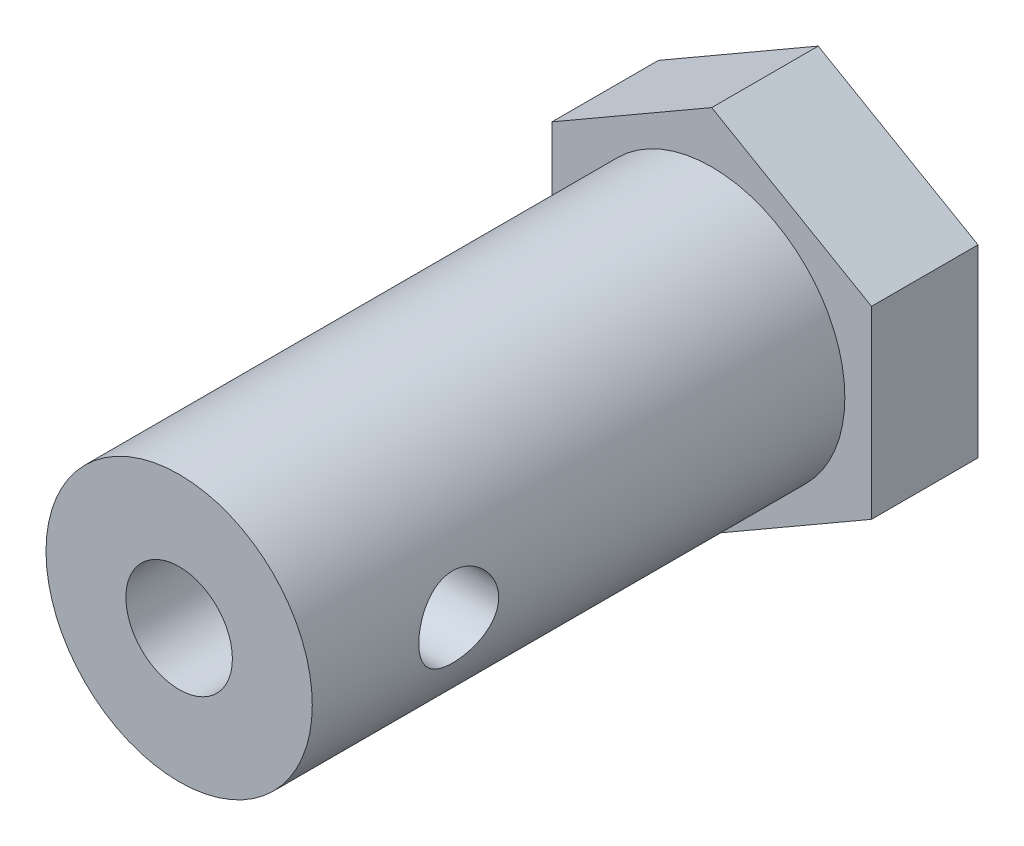
ISO-10303-21;
HEADER;
FILE_DESCRIPTION(('STEP AP214'),'2;1');
FILE_NAME('part.step','',(''),(''),'','','');
FILE_SCHEMA(('AUTOMOTIVE_DESIGN { 1 0 10303 214 1 1 1 1 }'));
ENDSEC;
DATA;
#1=APPLICATION_CONTEXT('core data for automotive mechanical design processes');
#2=APPLICATION_PROTOCOL_DEFINITION('international standard','automotive_design',2000,#1);
#3=PRODUCT_CONTEXT('',#1,'mechanical');
#4=PRODUCT('Part','Part','',(#3));
#5=PRODUCT_RELATED_PRODUCT_CATEGORY('part','',(#4));
#6=PRODUCT_DEFINITION_FORMATION('','',#4);
#7=PRODUCT_DEFINITION_CONTEXT('part definition',#1,'design');
#8=PRODUCT_DEFINITION('design','',#6,#7);
#9=PRODUCT_DEFINITION_SHAPE('','',#8);
#10=(LENGTH_UNIT() NAMED_UNIT(*) SI_UNIT(.MILLI.,.METRE.));
#11=(NAMED_UNIT(*) PLANE_ANGLE_UNIT() SI_UNIT($,.RADIAN.));
#12=(NAMED_UNIT(*) SI_UNIT($,.STERADIAN.) SOLID_ANGLE_UNIT());
#13=UNCERTAINTY_MEASURE_WITH_UNIT(LENGTH_MEASURE(1.E-05),#10,'distance_accuracy_value','');
#14=(GEOMETRIC_REPRESENTATION_CONTEXT(3) GLOBAL_UNCERTAINTY_ASSIGNED_CONTEXT((#13)) GLOBAL_UNIT_ASSIGNED_CONTEXT((#10,
#11,#12)) REPRESENTATION_CONTEXT('',''));
#15=CARTESIAN_POINT('',(0.,0.,0.));
#16=DIRECTION('',(0.,0.,1.));
#17=DIRECTION('',(1.,0.,0.));
#18=AXIS2_PLACEMENT_3D('',#15,#16,#17);
#19=CARTESIAN_POINT('',(0.,0.,24.));
#20=DIRECTION('',(0.,0.,-1.));
#21=DIRECTION('',(-1.,0.,0.));
#22=AXIS2_PLACEMENT_3D('',#19,#20,#21);
#23=CYLINDRICAL_SURFACE('',#22,5.);
#24=CARTESIAN_POINT('',(0.,0.,24.));
#25=DIRECTION('',(0.,0.,1.));
#26=DIRECTION('',(1.,0.,0.));
#27=AXIS2_PLACEMENT_3D('',#24,#25,#26);
#28=CIRCLE('',#27,5.);
#29=CARTESIAN_POINT('',(5.,0.,24.));
#30=VERTEX_POINT('',#29);
#31=EDGE_CURVE('E127',#30,#30,#28,.T.);
#32=ORIENTED_EDGE('',*,*,#31,.F.);
#33=EDGE_LOOP('',(#32));
#34=FACE_BOUND('',#33,.T.);
#35=CARTESIAN_POINT('',(0.,0.,4.));
#36=DIRECTION('',(0.,0.,1.));
#37=DIRECTION('',(1.,0.,0.));
#38=AXIS2_PLACEMENT_3D('',#35,#36,#37);
#39=CIRCLE('',#38,5.);
#40=CARTESIAN_POINT('',(5.,0.,4.));
#41=VERTEX_POINT('',#40);
#42=EDGE_CURVE('E203',#41,#41,#39,.T.);
#43=ORIENTED_EDGE('',*,*,#42,.T.);
#44=EDGE_LOOP('',(#43));
#45=FACE_BOUND('',#44,.T.);
#46=CARTESIAN_POINT('',(5.,0.,20.));
#47=CARTESIAN_POINT('',(4.9999992925055,-0.0822886127533,19.9999990025151));
#48=CARTESIAN_POINT('',(4.99794915693954,-0.16458731835153,19.993206136376));
#49=CARTESIAN_POINT('',(4.98997105593691,-0.326788125304881,19.9662786457779));
#50=CARTESIAN_POINT('',(4.98404193389692,-0.40668950441142,19.9461400419767));
#51=CARTESIAN_POINT('',(4.96895552501836,-0.561732707754526,19.8932539830897));
#52=CARTESIAN_POINT('',(4.95980300250425,-0.636881364395372,19.8605251303811));
#53=CARTESIAN_POINT('',(4.93922109237645,-0.78062418105313,19.7834639069442));
#54=CARTESIAN_POINT('',(4.92779140192067,-0.849217467469668,19.7391299926046));
#55=CARTESIAN_POINT('',(4.90350737192774,-0.979871797183744,19.6387759925273));
#56=CARTESIAN_POINT('',(4.89062383657036,-1.04171807124434,19.5824833741141));
#57=CARTESIAN_POINT('',(4.86505834210442,-1.15524920923324,19.4603907700898));
#58=CARTESIAN_POINT('',(4.85237641724501,-1.20693236327441,19.394589187875));
#59=CARTESIAN_POINT('',(4.82834113993772,-1.29980037723708,19.2535292469624));
#60=CARTESIAN_POINT('',(4.81702406663875,-1.34072309022213,19.1780915390093));
#61=CARTESIAN_POINT('',(4.79743620394031,-1.4092139477476,19.0210107457697));
#62=CARTESIAN_POINT('',(4.78916468313311,-1.43678529919973,18.939369156072));
#63=CARTESIAN_POINT('',(4.77690870838434,-1.47701633682652,18.7746097338695));
#64=CARTESIAN_POINT('',(4.77281069324533,-1.49007196234677,18.6915972561361));
#65=CARTESIAN_POINT('',(4.76902789749767,-1.50213730614672,18.5244668437832));
#66=CARTESIAN_POINT('',(4.76934204760571,-1.50115042761078,18.4403491819409));
#67=CARTESIAN_POINT('',(4.77424744067778,-1.48546977199812,18.2766160913915));
#68=CARTESIAN_POINT('',(4.7786838859914,-1.47127205262685,18.1969477496378));
#69=CARTESIAN_POINT('',(4.79108356228624,-1.43037420427056,18.0411802137265));
#70=CARTESIAN_POINT('',(4.79904714132351,-1.40367284141641,17.9650813726257));
#71=CARTESIAN_POINT('',(4.81772733074973,-1.33816026653682,17.8173996503393));
#72=CARTESIAN_POINT('',(4.82848016115952,-1.29918816934643,17.7458929160447));
#73=CARTESIAN_POINT('',(4.85150987000065,-1.21035222588683,17.6102679779898));
#74=CARTESIAN_POINT('',(4.86378711746991,-1.16048574002588,17.5461515705862));
#75=CARTESIAN_POINT('',(4.88911011297937,-1.04881290765546,17.424313809238));
#76=CARTESIAN_POINT('',(4.90216654310498,-0.986594907466973,17.3669713359703));
#77=CARTESIAN_POINT('',(4.92712244063258,-0.853263259313968,17.2634460159358));
#78=CARTESIAN_POINT('',(4.9390218351841,-0.78214905186089,17.2172638715856));
#79=CARTESIAN_POINT('',(4.9604316006947,-0.632355038342805,17.1371400775353));
#80=CARTESIAN_POINT('',(4.96992543668314,-0.553627749747951,17.1032824837501));
#81=CARTESIAN_POINT('',(4.98533521832222,-0.391245415603519,17.0494004099004));
#82=CARTESIAN_POINT('',(4.99125216186999,-0.307591751589582,17.0293720714675));
#83=CARTESIAN_POINT('',(4.99868364643538,-0.140952242668331,17.0043478221006));
#84=CARTESIAN_POINT('',(5.0003485041779,-0.0580500976011869,16.9988384141984));
#85=CARTESIAN_POINT('',(4.9995292324176,0.107499605823383,17.0015691557121));
#86=CARTESIAN_POINT('',(4.99704565677756,0.190147196690781,17.0098074696514));
#87=CARTESIAN_POINT('',(4.98830696987163,0.350903605309697,17.0393846111115));
#88=CARTESIAN_POINT('',(4.98213829799417,0.429072772614169,17.0604233875809));
#89=CARTESIAN_POINT('',(4.96674347841533,0.580754638954522,17.1146432327782));
#90=CARTESIAN_POINT('',(4.95751696321085,0.654266777025584,17.1478257610379));
#91=CARTESIAN_POINT('',(4.93669654351325,0.796437189461053,17.2262531654811));
#92=CARTESIAN_POINT('',(4.92505280829675,0.864943826199669,17.271759340948));
#93=CARTESIAN_POINT('',(4.90073468764317,0.993523307980147,17.3732247540528));
#94=CARTESIAN_POINT('',(4.8880600443108,1.05359403235594,17.4291866118877));
#95=CARTESIAN_POINT('',(4.86253171869138,1.16585744551027,17.5523873083693));
#96=CARTESIAN_POINT('',(4.84968825033268,1.21768481231504,17.6199618757717));
#97=CARTESIAN_POINT('',(4.82576515238463,1.30928995072154,17.7631279390135));
#98=CARTESIAN_POINT('',(4.81468547654651,1.34906803829472,17.8387192245582));
#99=CARTESIAN_POINT('',(4.79567189615055,1.41517347127168,17.9955324912547));
#100=CARTESIAN_POINT('',(4.78772337843827,1.4415634693705,18.0767261865366));
#101=CARTESIAN_POINT('',(4.77591594362794,1.48021730815114,18.2426879689315));
#102=CARTESIAN_POINT('',(4.772055625083,1.49248598978779,18.3274548207877));
#103=CARTESIAN_POINT('',(4.76899972496087,1.50221984485059,18.4943615183762));
#104=CARTESIAN_POINT('',(4.76961647442754,1.5002805530849,18.5764636510176));
#105=CARTESIAN_POINT('',(4.77499401288294,1.48307505444813,18.7391141033728));
#106=CARTESIAN_POINT('',(4.77975463592551,1.46780938124716,18.8196624851764));
#107=CARTESIAN_POINT('',(4.79275763670385,1.42476888804136,18.9759453991429));
#108=CARTESIAN_POINT('',(4.80095604545965,1.39715175507068,19.0517272873617));
#109=CARTESIAN_POINT('',(4.81990278909136,1.33031507121129,19.1976424388177));
#110=CARTESIAN_POINT('',(4.83065161194312,1.29109329962876,19.2677746176408));
#111=CARTESIAN_POINT('',(4.85397676425833,1.20048763805072,19.4031631165271));
#112=CARTESIAN_POINT('',(4.86660540163797,1.14871276092994,19.4681487612604));
#113=CARTESIAN_POINT('',(4.89201320450026,1.03517434629782,19.5887024983079));
#114=CARTESIAN_POINT('',(4.90479240823905,0.973408217134499,19.6442681394678));
#115=CARTESIAN_POINT('',(4.92950936570649,0.839465762183246,19.746023412295));
#116=CARTESIAN_POINT('',(4.94141159765674,0.767037885790605,19.7918914468555));
#117=CARTESIAN_POINT('',(4.96260680455813,0.615141373983528,19.870735169904));
#118=CARTESIAN_POINT('',(4.97190099931067,0.535676052998954,19.9037168882745));
#119=CARTESIAN_POINT('',(4.98602174969301,0.380757712655281,19.9528952756528));
#120=CARTESIAN_POINT('',(4.99122027381068,0.305786961954233,19.9705116728832));
#121=CARTESIAN_POINT('',(4.99820944494492,0.153880195230779,19.9940635252416));
#122=CARTESIAN_POINT('',(5.0000006615474,0.0769445098581394,20.0000009327048));
#123=CARTESIAN_POINT('',(5.,0.,20.));
#124=B_SPLINE_CURVE_WITH_KNOTS('',3,(#46,#47,#48,#49,#50,#51,#52,#53,#54,#55,#56,#57,#58,#59,
#60,#61,#62,#63,#64,#65,#66,#67,#68,#69,#70,#71,#72,#73,#74,#75,#76,#77,#78,#79,#80,#81,#82,#83,
#84,#85,#86,#87,#88,#89,#90,#91,#92,#93,#94,#95,#96,#97,#98,#99,#100,#101,#102,#103,#104,#105,
#106,#107,#108,#109,#110,#111,#112,#113,#114,#115,#116,#117,#118,#119,#120,#121,#122,#123),
.UNSPECIFIED.,.T.,.F.,(4,2,2,2,2,2,2,2,2,2,2,2,2,2,2,2,2,2,2,2,2,2,2,2,2,2,2,2,2,2,2,2,2,2,2,2,
2,2,4),(0.,0.246583203612611,0.493239964845999,0.739533676300873,0.985860164412701,
1.23855602948191,1.49129437288633,1.74971481004109,2.00807314543224,2.25919689356599,
2.5102597831909,2.75226016697676,2.99428443658001,3.23962426447119,3.48502360158555,
3.74067104048167,3.99633456531072,4.25371046881689,4.51101453528808,4.75908809438545,
5.00712853550327,5.24956746682327,5.49203554593729,5.74011305702908,5.98825282000191,
6.24540400322819,6.50254844252681,6.75847814951252,7.01432009460283,7.25950155466943,
7.504673196616,7.74680040402721,7.98897397553108,8.23996925679931,8.49102974897503,
8.74942996156671,9.00770911595235,9.2383169193046,9.46888616948875),.UNSPECIFIED.);
#125=CARTESIAN_POINT('',(5.,0.,20.));
#126=VERTEX_POINT('',#125);
#127=EDGE_CURVE('E173',#126,#126,#124,.T.);
#128=ORIENTED_EDGE('',*,*,#127,.F.);
#129=EDGE_LOOP('',(#128));
#130=FACE_BOUND('',#129,.T.);
#131=ADVANCED_FACE('F33',(#34,#45,#130),#23,.T.);
#132=CARTESIAN_POINT('',(0.,0.,14.));
#133=DIRECTION('',(0.,0.,1.));
#134=DIRECTION('',(1.,0.,0.));
#135=AXIS2_PLACEMENT_3D('',#132,#133,#134);
#136=CYLINDRICAL_SURFACE('',#135,2.);
#137=CARTESIAN_POINT('',(0.,0.,14.));
#138=DIRECTION('',(0.,0.,1.));
#139=DIRECTION('',(1.,0.,0.));
#140=AXIS2_PLACEMENT_3D('',#137,#138,#139);
#141=CIRCLE('',#140,2.);
#142=CARTESIAN_POINT('',(2.,0.,14.));
#143=VERTEX_POINT('',#142);
#144=EDGE_CURVE('E182',#143,#143,#141,.T.);
#145=ORIENTED_EDGE('',*,*,#144,.F.);
#146=EDGE_LOOP('',(#145));
#147=FACE_BOUND('',#146,.T.);
#148=CARTESIAN_POINT('',(0.,0.,24.));
#149=DIRECTION('',(0.,0.,1.));
#150=DIRECTION('',(1.,0.,0.));
#151=AXIS2_PLACEMENT_3D('',#148,#149,#150);
#152=CIRCLE('',#151,2.);
#153=CARTESIAN_POINT('',(2.,0.,24.));
#154=VERTEX_POINT('',#153);
#155=EDGE_CURVE('E179',#154,#154,#152,.T.);
#156=ORIENTED_EDGE('',*,*,#155,.T.);
#157=EDGE_LOOP('',(#156));
#158=FACE_BOUND('',#157,.T.);
#159=CARTESIAN_POINT('',(2.,0.,17.));
#160=CARTESIAN_POINT('',(1.99999540196395,-0.0732207358411545,17.000004792012));
#161=CARTESIAN_POINT('',(1.99593645526274,-0.146561062021486,17.0054050243745));
#162=CARTESIAN_POINT('',(1.98006607281083,-0.290936396286467,17.0266670634102));
#163=CARTESIAN_POINT('',(1.96823514679854,-0.361965136229004,17.0425551716501));
#164=CARTESIAN_POINT('',(1.9379567495606,-0.499234626631249,17.0837129092838));
#165=CARTESIAN_POINT('',(1.91954951932009,-0.565501615403737,17.1089255135692));
#166=CARTESIAN_POINT('',(1.87750556721694,-0.692422335520753,17.1675423441872));
#167=CARTESIAN_POINT('',(1.85387037535483,-0.753077701796332,17.2009441741935));
#168=CARTESIAN_POINT('',(1.80049544543983,-0.873465937590145,17.2782630115908));
#169=CARTESIAN_POINT('',(1.77039308548439,-0.932593229272033,17.3228673293341));
#170=CARTESIAN_POINT('',(1.70767017883378,-1.04302716767671,17.4194958373612));
#171=CARTESIAN_POINT('',(1.67504578078609,-1.09432148272226,17.4715314827998));
#172=CARTESIAN_POINT('',(1.6027112365199,-1.19837161436623,17.5935829532784));
#173=CARTESIAN_POINT('',(1.56290854864639,-1.24930578421204,17.6651036771217));
#174=CARTESIAN_POINT('',(1.48711444664135,-1.33861998176348,17.8174510123665));
#175=CARTESIAN_POINT('',(1.45111786883675,-1.37701716983077,17.8982646970003));
#176=CARTESIAN_POINT('',(1.39977155180178,-1.42880627811788,18.0395028386762));
#177=CARTESIAN_POINT('',(1.38157751186733,-1.44625674456539,18.0973906971284));
#178=CARTESIAN_POINT('',(1.35171594150685,-1.47420672564844,18.2163927347849));
#179=CARTESIAN_POINT('',(1.34003347910832,-1.48472215355267,18.2774991778748));
#180=CARTESIAN_POINT('',(1.32503759684552,-1.49812822141445,18.4021825855308));
#181=CARTESIAN_POINT('',(1.32180026676597,-1.50094954854207,18.4657768067241));
#182=CARTESIAN_POINT('',(1.32459531776068,-1.49848213241869,18.5926149108816));
#183=CARTESIAN_POINT('',(1.33063102218113,-1.49319048157349,18.6558586600874));
#184=CARTESIAN_POINT('',(1.34967623262519,-1.47597739291882,18.7731913474258));
#185=CARTESIAN_POINT('',(1.36187157059871,-1.46482486380817,18.8275363710462));
#186=CARTESIAN_POINT('',(1.39114192844939,-1.43705671120733,18.9334388787209));
#187=CARTESIAN_POINT('',(1.40822163640769,-1.42043583681172,18.9849936278236));
#188=CARTESIAN_POINT('',(1.45741769294306,-1.37033064172535,19.1162563866342));
#189=CARTESIAN_POINT('',(1.49225649139232,-1.3328014849398,19.1934004166435));
#190=CARTESIAN_POINT('',(1.56533298145196,-1.24618023314519,19.3391965238691));
#191=CARTESIAN_POINT('',(1.60357878886109,-1.19706004255878,19.4078273392547));
#192=CARTESIAN_POINT('',(1.68051672313145,-1.08651604102135,19.5377533904037));
#193=CARTESIAN_POINT('',(1.71919586730239,-1.02481375526036,19.5988206068815));
#194=CARTESIAN_POINT('',(1.79248037980972,-0.890422521709589,19.7102636467812));
#195=CARTESIAN_POINT('',(1.8270934826376,-0.817755054293755,19.7606599202304));
#196=CARTESIAN_POINT('',(1.88279726073643,-0.67790208045414,19.8399807992403));
#197=CARTESIAN_POINT('',(1.90520770945008,-0.612539870185618,19.8711845942158));
#198=CARTESIAN_POINT('',(1.94372904416948,-0.476352173202084,19.9242248804639));
#199=CARTESIAN_POINT('',(1.95984387504352,-0.405530141063764,19.9460672384993));
#200=CARTESIAN_POINT('',(1.98445588635989,-0.259676232483516,19.9792533628864));
#201=CARTESIAN_POINT('',(1.99290592971749,-0.18462128140594,19.9905321789386));
#202=CARTESIAN_POINT('',(2.00115883659445,-0.0332012397969146,20.0015495973717));
#203=CARTESIAN_POINT('',(2.00096534845408,0.0431632843727259,20.0012930686954));
#204=CARTESIAN_POINT('',(1.99242547175873,0.186804217329628,19.9898891307268));
#205=CARTESIAN_POINT('',(1.98490086600401,0.254222327546136,19.9798394631113));
#206=CARTESIAN_POINT('',(1.96351320201588,0.386110670609121,19.9510262199921));
#207=CARTESIAN_POINT('',(1.94964879507262,0.450580272987263,19.9322607903106));
#208=CARTESIAN_POINT('',(1.91599830683313,0.577416779689772,19.8861124694069));
#209=CARTESIAN_POINT('',(1.89602050290193,0.639629172536142,19.8584488185726));
#210=CARTESIAN_POINT('',(1.85166985411962,0.758518527043076,19.7958275445744));
#211=CARTESIAN_POINT('',(1.82729640132067,0.815194721336406,19.7608689123603));
#212=CARTESIAN_POINT('',(1.77119146886499,0.931511626319039,19.6782167535894));
#213=CARTESIAN_POINT('',(1.73891095025037,0.990066762698704,19.6293714605625));
#214=CARTESIAN_POINT('',(1.67238952874785,1.09871974855854,19.5239912474116));
#215=CARTESIAN_POINT('',(1.63814438507395,1.14879830469577,19.4674393003066));
#216=CARTESIAN_POINT('',(1.56369128291496,1.24877541075626,19.3358501190388));
#217=CARTESIAN_POINT('',(1.523587185201,1.29683043648705,19.2593424385077));
#218=CARTESIAN_POINT('',(1.4494059134845,1.37923235998283,19.0966399220275));
#219=CARTESIAN_POINT('',(1.41531099570969,1.41362000515519,19.0104748780914));
#220=CARTESIAN_POINT('',(1.37118877808582,1.45615734256767,18.8645855511255));
#221=CARTESIAN_POINT('',(1.35695811824564,1.46931009512996,18.8076088735976));
#222=CARTESIAN_POINT('',(1.3354205610301,1.48891522181906,18.6912929530168));
#223=CARTESIAN_POINT('',(1.32809821220233,1.4953825519924,18.6319592931977));
#224=CARTESIAN_POINT('',(1.32157601792209,1.50115320209064,18.5121709201887));
#225=CARTESIAN_POINT('',(1.32241740684975,1.50042015325262,18.4517120569904));
#226=CARTESIAN_POINT('',(1.33216448543666,1.49176883838219,18.3319431612478));
#227=CARTESIAN_POINT('',(1.34108058157484,1.48384130024584,18.2726347121027));
#228=CARTESIAN_POINT('',(1.36817348797773,1.45893841819723,18.1440854285892));
#229=CARTESIAN_POINT('',(1.38794705950644,1.44036567954111,18.0755028198672));
#230=CARTESIAN_POINT('',(1.4338296338541,1.39469627266118,17.9434651511695));
#231=CARTESIAN_POINT('',(1.4599546014693,1.36757807297729,17.8800235579618));
#232=CARTESIAN_POINT('',(1.52516477328824,1.29498918933642,17.7374793695137));
#233=CARTESIAN_POINT('',(1.56560203191105,1.2464154206597,17.6605784172442));
#234=CARTESIAN_POINT('',(1.64713510181273,1.13650718465935,17.5168739550224));
#235=CARTESIAN_POINT('',(1.68823146954223,1.07516134758576,17.4500795340551));
#236=CARTESIAN_POINT('',(1.76728988939794,0.939627144937881,17.3271681577167));
#237=CARTESIAN_POINT('',(1.80522333711072,0.865337161562849,17.2711436806228));
#238=CARTESIAN_POINT('',(1.87357289668097,0.705159098936189,17.1727769488546));
#239=CARTESIAN_POINT('',(1.90400691592959,0.619299420401779,17.1304020254275));
#240=CARTESIAN_POINT('',(1.94636704624048,0.464840290356438,17.0722005790143));
#241=CARTESIAN_POINT('',(1.96110322499718,0.398553614774715,17.0522332686238));
#242=CARTESIAN_POINT('',(1.98383739970238,0.262841610392743,17.0215820973885));
#243=CARTESIAN_POINT('',(1.99185421210894,0.193425623834889,17.01087230975));
#244=CARTESIAN_POINT('',(1.99745471706309,0.102963309861876,17.0033953057857));
#245=CARTESIAN_POINT('',(1.9984076143208,0.0824069459941131,17.0021237225106));
#246=CARTESIAN_POINT('',(1.99968095423138,0.041236889624373,17.000425326769));
#247=CARTESIAN_POINT('',(2.00000129507253,0.0206231884283855,16.9999986502926));
#248=CARTESIAN_POINT('',(2.,0.,17.));
#249=B_SPLINE_CURVE_WITH_KNOTS('',3,(#159,#160,#161,#162,#163,#164,#165,#166,#167,#168,#169,
#170,#171,#172,#173,#174,#175,#176,#177,#178,#179,#180,#181,#182,#183,#184,#185,#186,#187,#188,
#189,#190,#191,#192,#193,#194,#195,#196,#197,#198,#199,#200,#201,#202,#203,#204,#205,#206,#207,
#208,#209,#210,#211,#212,#213,#214,#215,#216,#217,#218,#219,#220,#221,#222,#223,#224,#225,#226,
#227,#228,#229,#230,#231,#232,#233,#234,#235,#236,#237,#238,#239,#240,#241,#242,#243,#244,#245,
#246,#247,#248),.UNSPECIFIED.,.T.,.F.,(4,2,2,2,2,2,2,2,2,2,2,2,2,2,2,2,2,2,2,2,2,2,2,2,2,2,2,2,
2,2,2,2,2,2,2,2,2,2,2,2,2,2,2,2,4),(0.,0.219571786572042,0.439696319423244,0.658496333573381,
0.877232398849294,1.1162243131743,1.35558868405162,1.64360015887451,1.93121574056507,
2.11999518529902,2.3083399319529,2.49837587621257,2.6884799430021,2.85826890162709,
3.0282213760064,3.3044933180591,3.5814419235789,3.86535883938091,4.14872662493691,
4.3752650500639,4.60166129643118,4.82944058166899,5.05712372466614,5.26191187011995,
5.46674360185813,5.67880439483681,5.89089453977542,6.13840382081868,6.38646908985452,
6.68168596015947,6.97601595850113,7.15589161422934,7.33536399114209,7.51574333854743,
7.69635548563855,7.91639670960136,8.13699685139923,8.4341224665577,8.73151372390895,
9.03135449492652,9.33047220273166,9.54195697541632,9.75284752283259,9.81468166878712,
9.87652576630966),.UNSPECIFIED.);
#250=CARTESIAN_POINT('',(2.,0.,17.));
#251=VERTEX_POINT('',#250);
#252=EDGE_CURVE('E37',#251,#251,#249,.T.);
#253=ORIENTED_EDGE('',*,*,#252,.F.);
#254=EDGE_LOOP('',(#253));
#255=FACE_BOUND('',#254,.T.);
#256=ADVANCED_FACE('F160',(#147,#158,#255),#136,.F.);
#257=CARTESIAN_POINT('',(6.,3.46410161513776,4.));
#258=DIRECTION('',(-0.5,-0.866025403784439,0.));
#259=DIRECTION('',(0.866025403784439,-0.5,0.));
#260=AXIS2_PLACEMENT_3D('',#257,#258,#259);
#261=PLANE('',#260);
#262=DIRECTION('',(-0.866025403784439,0.5,0.));
#263=VECTOR('',#262,1.);
#264=CARTESIAN_POINT('',(6.,3.46410161513776,0.));
#265=LINE('',#264,#263);
#266=CARTESIAN_POINT('',(6.,3.46410161513776,0.));
#267=VERTEX_POINT('',#266);
#268=CARTESIAN_POINT('',(0.,6.92820323027551,0.));
#269=VERTEX_POINT('',#268);
#270=EDGE_CURVE('E123',#267,#269,#265,.T.);
#271=ORIENTED_EDGE('',*,*,#270,.T.);
#272=DIRECTION('',(0.,0.,-1.));
#273=VECTOR('',#272,1.);
#274=CARTESIAN_POINT('',(0.,6.92820323027551,4.));
#275=LINE('',#274,#273);
#276=CARTESIAN_POINT('',(0.,6.92820323027551,4.));
#277=VERTEX_POINT('',#276);
#278=EDGE_CURVE('E11',#277,#269,#275,.T.);
#279=ORIENTED_EDGE('',*,*,#278,.F.);
#280=DIRECTION('',(-0.866025403784439,0.5,0.));
#281=VECTOR('',#280,1.);
#282=CARTESIAN_POINT('',(6.,3.46410161513776,4.));
#283=LINE('',#282,#281);
#284=CARTESIAN_POINT('',(6.,3.46410161513776,4.));
#285=VERTEX_POINT('',#284);
#286=EDGE_CURVE('E134',#285,#277,#283,.T.);
#287=ORIENTED_EDGE('',*,*,#286,.F.);
#288=DIRECTION('',(0.,0.,-1.));
#289=VECTOR('',#288,1.);
#290=CARTESIAN_POINT('',(6.,3.46410161513776,4.));
#291=LINE('',#290,#289);
#292=EDGE_CURVE('E119',#285,#267,#291,.T.);
#293=ORIENTED_EDGE('',*,*,#292,.T.);
#294=EDGE_LOOP('',(#271,#279,#287,#293));
#295=FACE_BOUND('',#294,.T.);
#296=ADVANCED_FACE('F35',(#295),#261,.F.);
#297=CARTESIAN_POINT('',(0.,6.92820323027551,4.));
#298=DIRECTION('',(0.5,-0.866025403784439,0.));
#299=DIRECTION('',(0.866025403784439,0.5,0.));
#300=AXIS2_PLACEMENT_3D('',#297,#298,#299);
#301=PLANE('',#300);
#302=DIRECTION('',(-0.866025403784439,-0.5,0.));
#303=VECTOR('',#302,1.);
#304=CARTESIAN_POINT('',(0.,6.92820323027551,0.));
#305=LINE('',#304,#303);
#306=CARTESIAN_POINT('',(-6.,3.46410161513775,0.));
#307=VERTEX_POINT('',#306);
#308=EDGE_CURVE('E126',#269,#307,#305,.T.);
#309=ORIENTED_EDGE('',*,*,#308,.T.);
#310=DIRECTION('',(0.,0.,-1.));
#311=VECTOR('',#310,1.);
#312=CARTESIAN_POINT('',(-6.,3.46410161513775,4.));
#313=LINE('',#312,#311);
#314=CARTESIAN_POINT('',(-6.,3.46410161513775,4.));
#315=VERTEX_POINT('',#314);
#316=EDGE_CURVE('E47',#315,#307,#313,.T.);
#317=ORIENTED_EDGE('',*,*,#316,.F.);
#318=DIRECTION('',(-0.866025403784439,-0.5,0.));
#319=VECTOR('',#318,1.);
#320=CARTESIAN_POINT('',(0.,6.92820323027551,4.));
#321=LINE('',#320,#319);
#322=EDGE_CURVE('E92',#277,#315,#321,.T.);
#323=ORIENTED_EDGE('',*,*,#322,.F.);
#324=ORIENTED_EDGE('',*,*,#278,.T.);
#325=EDGE_LOOP('',(#309,#317,#323,#324));
#326=FACE_BOUND('',#325,.T.);
#327=ADVANCED_FACE('F280',(#326),#301,.F.);
#328=CARTESIAN_POINT('',(-6.,3.46410161513775,4.));
#329=DIRECTION('',(1.,0.,0.));
#330=DIRECTION('',(0.,1.,0.));
#331=AXIS2_PLACEMENT_3D('',#328,#329,#330);
#332=PLANE('',#331);
#333=DIRECTION('',(0.,-1.,0.));
#334=VECTOR('',#333,1.);
#335=CARTESIAN_POINT('',(-6.,3.46410161513775,0.));
#336=LINE('',#335,#334);
#337=CARTESIAN_POINT('',(-6.,-3.46410161513776,0.));
#338=VERTEX_POINT('',#337);
#339=EDGE_CURVE('E129',#307,#338,#336,.T.);
#340=ORIENTED_EDGE('',*,*,#339,.T.);
#341=DIRECTION('',(0.,0.,-1.));
#342=VECTOR('',#341,1.);
#343=CARTESIAN_POINT('',(-6.,-3.46410161513776,4.));
#344=LINE('',#343,#342);
#345=CARTESIAN_POINT('',(-6.,-3.46410161513776,4.));
#346=VERTEX_POINT('',#345);
#347=EDGE_CURVE('E114',#346,#338,#344,.T.);
#348=ORIENTED_EDGE('',*,*,#347,.F.);
#349=DIRECTION('',(0.,-1.,0.));
#350=VECTOR('',#349,1.);
#351=CARTESIAN_POINT('',(-6.,3.46410161513775,4.));
#352=LINE('',#351,#350);
#353=EDGE_CURVE('E105',#315,#346,#352,.T.);
#354=ORIENTED_EDGE('',*,*,#353,.F.);
#355=ORIENTED_EDGE('',*,*,#316,.T.);
#356=EDGE_LOOP('',(#340,#348,#354,#355));
#357=FACE_BOUND('',#356,.T.);
#358=ADVANCED_FACE('F141',(#357),#332,.F.);
#359=CARTESIAN_POINT('',(-6.,-3.46410161513776,4.));
#360=DIRECTION('',(0.5,0.866025403784439,0.));
#361=DIRECTION('',(-0.866025403784439,0.5,0.));
#362=AXIS2_PLACEMENT_3D('',#359,#360,#361);
#363=PLANE('',#362);
#364=DIRECTION('',(0.866025403784439,-0.5,0.));
#365=VECTOR('',#364,1.);
#366=CARTESIAN_POINT('',(-6.,-3.46410161513776,0.));
#367=LINE('',#366,#365);
#368=CARTESIAN_POINT('',(0.,-6.92820323027551,0.));
#369=VERTEX_POINT('',#368);
#370=EDGE_CURVE('E113',#338,#369,#367,.T.);
#371=ORIENTED_EDGE('',*,*,#370,.T.);
#372=DIRECTION('',(0.,0.,-1.));
#373=VECTOR('',#372,1.);
#374=CARTESIAN_POINT('',(0.,-6.92820323027551,4.));
#375=LINE('',#374,#373);
#376=CARTESIAN_POINT('',(0.,-6.92820323027551,4.));
#377=VERTEX_POINT('',#376);
#378=EDGE_CURVE('E110',#377,#369,#375,.T.);
#379=ORIENTED_EDGE('',*,*,#378,.F.);
#380=DIRECTION('',(0.866025403784439,-0.5,0.));
#381=VECTOR('',#380,1.);
#382=CARTESIAN_POINT('',(-6.,-3.46410161513776,4.));
#383=LINE('',#382,#381);
#384=EDGE_CURVE('E99',#346,#377,#383,.T.);
#385=ORIENTED_EDGE('',*,*,#384,.F.);
#386=ORIENTED_EDGE('',*,*,#347,.T.);
#387=EDGE_LOOP('',(#371,#379,#385,#386));
#388=FACE_BOUND('',#387,.T.);
#389=ADVANCED_FACE('F111',(#388),#363,.F.);
#390=CARTESIAN_POINT('',(0.,-6.92820323027551,4.));
#391=DIRECTION('',(-0.5,0.866025403784439,0.));
#392=DIRECTION('',(-0.866025403784439,-0.5,0.));
#393=AXIS2_PLACEMENT_3D('',#390,#391,#392);
#394=PLANE('',#393);
#395=DIRECTION('',(0.866025403784439,0.5,0.));
#396=VECTOR('',#395,1.);
#397=CARTESIAN_POINT('',(0.,-6.92820323027551,0.));
#398=LINE('',#397,#396);
#399=CARTESIAN_POINT('',(6.,-3.46410161513775,0.));
#400=VERTEX_POINT('',#399);
#401=EDGE_CURVE('E78',#369,#400,#398,.T.);
#402=ORIENTED_EDGE('',*,*,#401,.T.);
#403=DIRECTION('',(0.,0.,-1.));
#404=VECTOR('',#403,1.);
#405=CARTESIAN_POINT('',(6.,-3.46410161513775,4.));
#406=LINE('',#405,#404);
#407=CARTESIAN_POINT('',(6.,-3.46410161513775,4.));
#408=VERTEX_POINT('',#407);
#409=EDGE_CURVE('E115',#408,#400,#406,.T.);
#410=ORIENTED_EDGE('',*,*,#409,.F.);
#411=DIRECTION('',(0.866025403784439,0.5,0.));
#412=VECTOR('',#411,1.);
#413=CARTESIAN_POINT('',(0.,-6.92820323027551,4.));
#414=LINE('',#413,#412);
#415=EDGE_CURVE('E103',#377,#408,#414,.T.);
#416=ORIENTED_EDGE('',*,*,#415,.F.);
#417=ORIENTED_EDGE('',*,*,#378,.T.);
#418=EDGE_LOOP('',(#402,#410,#416,#417));
#419=FACE_BOUND('',#418,.T.);
#420=ADVANCED_FACE('F117',(#419),#394,.F.);
#421=CARTESIAN_POINT('',(6.,-3.46410161513775,4.));
#422=DIRECTION('',(-1.,0.,0.));
#423=DIRECTION('',(0.,-1.,0.));
#424=AXIS2_PLACEMENT_3D('',#421,#422,#423);
#425=PLANE('',#424);
#426=DIRECTION('',(0.,1.,0.));
#427=VECTOR('',#426,1.);
#428=CARTESIAN_POINT('',(6.,-3.46410161513775,0.));
#429=LINE('',#428,#427);
#430=EDGE_CURVE('E84',#400,#267,#429,.T.);
#431=ORIENTED_EDGE('',*,*,#430,.T.);
#432=ORIENTED_EDGE('',*,*,#292,.F.);
#433=DIRECTION('',(0.,1.,0.));
#434=VECTOR('',#433,1.);
#435=CARTESIAN_POINT('',(6.,-3.46410161513775,4.));
#436=LINE('',#435,#434);
#437=EDGE_CURVE('E55',#408,#285,#436,.T.);
#438=ORIENTED_EDGE('',*,*,#437,.F.);
#439=ORIENTED_EDGE('',*,*,#409,.T.);
#440=EDGE_LOOP('',(#431,#432,#438,#439));
#441=FACE_BOUND('',#440,.T.);
#442=ADVANCED_FACE('F148',(#441),#425,.F.);
#443=CARTESIAN_POINT('',(0.,0.,4.));
#444=DIRECTION('',(0.,0.,1.));
#445=DIRECTION('',(1.,0.,0.));
#446=AXIS2_PLACEMENT_3D('',#443,#444,#445);
#447=PLANE('',#446);
#448=ORIENTED_EDGE('',*,*,#42,.F.);
#449=EDGE_LOOP('',(#448));
#450=FACE_BOUND('',#449,.T.);
#451=ORIENTED_EDGE('',*,*,#286,.T.);
#452=ORIENTED_EDGE('',*,*,#322,.T.);
#453=ORIENTED_EDGE('',*,*,#353,.T.);
#454=ORIENTED_EDGE('',*,*,#384,.T.);
#455=ORIENTED_EDGE('',*,*,#415,.T.);
#456=ORIENTED_EDGE('',*,*,#437,.T.);
#457=EDGE_LOOP('',(#451,#452,#453,#454,#455,#456));
#458=FACE_BOUND('',#457,.T.);
#459=ADVANCED_FACE('F101',(#450,#458),#447,.T.);
#460=CARTESIAN_POINT('',(0.,0.,0.));
#461=DIRECTION('',(0.,0.,1.));
#462=DIRECTION('',(1.,0.,0.));
#463=AXIS2_PLACEMENT_3D('',#460,#461,#462);
#464=PLANE('',#463);
#465=CARTESIAN_POINT('',(0.,0.,0.));
#466=DIRECTION('',(0.,0.,-1.));
#467=DIRECTION('',(-1.,0.,0.));
#468=AXIS2_PLACEMENT_3D('',#465,#466,#467);
#469=CIRCLE('',#468,1.5);
#470=CARTESIAN_POINT('',(-1.5,0.,0.));
#471=VERTEX_POINT('',#470);
#472=EDGE_CURVE('E180',#471,#471,#469,.T.);
#473=ORIENTED_EDGE('',*,*,#472,.F.);
#474=EDGE_LOOP('',(#473));
#475=FACE_BOUND('',#474,.T.);
#476=ORIENTED_EDGE('',*,*,#270,.F.);
#477=ORIENTED_EDGE('',*,*,#430,.F.);
#478=ORIENTED_EDGE('',*,*,#401,.F.);
#479=ORIENTED_EDGE('',*,*,#370,.F.);
#480=ORIENTED_EDGE('',*,*,#339,.F.);
#481=ORIENTED_EDGE('',*,*,#308,.F.);
#482=EDGE_LOOP('',(#476,#477,#478,#479,#480,#481));
#483=FACE_BOUND('',#482,.T.);
#484=ADVANCED_FACE('F144',(#475,#483),#464,.F.);
#485=CARTESIAN_POINT('',(0.,0.,24.));
#486=DIRECTION('',(0.,0.,1.));
#487=DIRECTION('',(1.,0.,0.));
#488=AXIS2_PLACEMENT_3D('',#485,#486,#487);
#489=PLANE('',#488);
#490=ORIENTED_EDGE('',*,*,#155,.F.);
#491=EDGE_LOOP('',(#490));
#492=FACE_BOUND('',#491,.T.);
#493=ORIENTED_EDGE('',*,*,#31,.T.);
#494=EDGE_LOOP('',(#493));
#495=FACE_BOUND('',#494,.T.);
#496=ADVANCED_FACE('F171',(#492,#495),#489,.T.);
#497=CARTESIAN_POINT('',(0.,0.,14.));
#498=DIRECTION('',(0.,0.,1.));
#499=DIRECTION('',(1.,0.,0.));
#500=AXIS2_PLACEMENT_3D('',#497,#498,#499);
#501=PLANE('',#500);
#502=ORIENTED_EDGE('',*,*,#144,.T.);
#503=EDGE_LOOP('',(#502));
#504=FACE_BOUND('',#503,.T.);
#505=ADVANCED_FACE('F190',(#504),#501,.T.);
#506=CARTESIAN_POINT('',(7.,0.,18.5));
#507=DIRECTION('',(-1.,0.,0.));
#508=DIRECTION('',(0.,0.,1.));
#509=AXIS2_PLACEMENT_3D('',#506,#507,#508);
#510=CYLINDRICAL_SURFACE('',#509,1.5);
#511=ORIENTED_EDGE('',*,*,#252,.T.);
#512=EDGE_LOOP('',(#511));
#513=FACE_BOUND('',#512,.T.);
#514=ORIENTED_EDGE('',*,*,#127,.T.);
#515=EDGE_LOOP('',(#514));
#516=FACE_BOUND('',#515,.T.);
#517=ADVANCED_FACE('F184',(#513,#516),#510,.F.);
#518=CARTESIAN_POINT('',(0.,0.,10.));
#519=DIRECTION('',(0.,0.,-1.));
#520=DIRECTION('',(-1.,0.,0.));
#521=AXIS2_PLACEMENT_3D('',#518,#519,#520);
#522=CYLINDRICAL_SURFACE('',#521,1.5);
#523=CARTESIAN_POINT('',(0.,0.,10.));
#524=DIRECTION('',(0.,0.,-1.));
#525=DIRECTION('',(-1.,0.,0.));
#526=AXIS2_PLACEMENT_3D('',#523,#524,#525);
#527=CIRCLE('',#526,1.5);
#528=CARTESIAN_POINT('',(-1.5,0.,10.));
#529=VERTEX_POINT('',#528);
#530=EDGE_CURVE('E217',#529,#529,#527,.T.);
#531=ORIENTED_EDGE('',*,*,#530,.F.);
#532=EDGE_LOOP('',(#531));
#533=FACE_BOUND('',#532,.T.);
#534=ORIENTED_EDGE('',*,*,#472,.T.);
#535=EDGE_LOOP('',(#534));
#536=FACE_BOUND('',#535,.T.);
#537=ADVANCED_FACE('F189',(#533,#536),#522,.F.);
#538=CARTESIAN_POINT('',(0.,0.,10.));
#539=DIRECTION('',(0.,0.,-1.));
#540=DIRECTION('',(-1.,0.,0.));
#541=AXIS2_PLACEMENT_3D('',#538,#539,#540);
#542=PLANE('',#541);
#543=ORIENTED_EDGE('',*,*,#530,.T.);
#544=EDGE_LOOP('',(#543));
#545=FACE_BOUND('',#544,.T.);
#546=ADVANCED_FACE('F266',(#545),#542,.T.);
#547=CLOSED_SHELL('',(#131,#256,#296,#327,#358,#389,#420,#442,#459,#484,#496,#505,#517,#537,#546));
#548=MANIFOLD_SOLID_BREP('B2',#547);
#549=ADVANCED_BREP_SHAPE_REPRESENTATION('',(#18,#548),#14);
#550=SHAPE_DEFINITION_REPRESENTATION(#9,#549);
ENDSEC;
END-ISO-10303-21;
